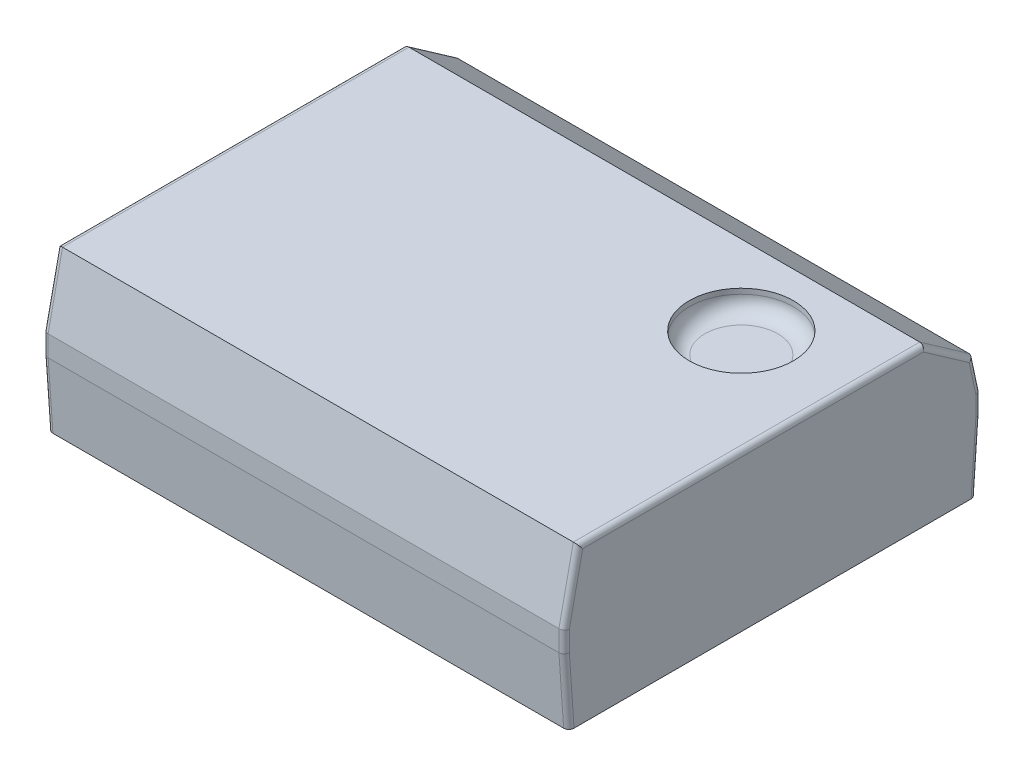
ISO-10303-21;
HEADER;
FILE_DESCRIPTION(('STEP AP214'),'2;1');
FILE_NAME('part.step','',(''),(''),'','','');
FILE_SCHEMA(('AUTOMOTIVE_DESIGN { 1 0 10303 214 1 1 1 1 }'));
ENDSEC;
DATA;
#1=APPLICATION_CONTEXT('core data for automotive mechanical design processes');
#2=APPLICATION_PROTOCOL_DEFINITION('international standard','automotive_design',2000,#1);
#3=PRODUCT_CONTEXT('',#1,'mechanical');
#4=PRODUCT('Part','Part','',(#3));
#5=PRODUCT_RELATED_PRODUCT_CATEGORY('part','',(#4));
#6=PRODUCT_DEFINITION_FORMATION('','',#4);
#7=PRODUCT_DEFINITION_CONTEXT('part definition',#1,'design');
#8=PRODUCT_DEFINITION('design','',#6,#7);
#9=PRODUCT_DEFINITION_SHAPE('','',#8);
#10=(LENGTH_UNIT() NAMED_UNIT(*) SI_UNIT(.MILLI.,.METRE.));
#11=(NAMED_UNIT(*) PLANE_ANGLE_UNIT() SI_UNIT($,.RADIAN.));
#12=(NAMED_UNIT(*) SI_UNIT($,.STERADIAN.) SOLID_ANGLE_UNIT());
#13=UNCERTAINTY_MEASURE_WITH_UNIT(LENGTH_MEASURE(1.E-05),#10,'distance_accuracy_value','');
#14=(GEOMETRIC_REPRESENTATION_CONTEXT(3) GLOBAL_UNCERTAINTY_ASSIGNED_CONTEXT((#13)) GLOBAL_UNIT_ASSIGNED_CONTEXT((#10,
#11,#12)) REPRESENTATION_CONTEXT('',''));
#15=CARTESIAN_POINT('',(0.,0.,0.));
#16=DIRECTION('',(0.,0.,1.));
#17=DIRECTION('',(1.,0.,0.));
#18=AXIS2_PLACEMENT_3D('',#15,#16,#17);
#19=CARTESIAN_POINT('',(1.5,0.55,-0.7));
#20=DIRECTION('',(0.,1.,0.));
#21=DIRECTION('',(0.,0.,1.));
#22=AXIS2_PLACEMENT_3D('',#19,#20,#21);
#23=PLANE('',#22);
#24=CARTESIAN_POINT('',(1.5,0.55,-0.7));
#25=DIRECTION('',(0.,1.,0.));
#26=DIRECTION('',(0.,0.,1.));
#27=AXIS2_PLACEMENT_3D('',#24,#25,#26);
#28=CIRCLE('',#27,0.35);
#29=CARTESIAN_POINT('',(1.5,0.55,-0.35));
#30=VERTEX_POINT('',#29);
#31=EDGE_CURVE('E21',#30,#30,#28,.T.);
#32=ORIENTED_EDGE('',*,*,#31,.T.);
#33=EDGE_LOOP('',(#32));
#34=FACE_BOUND('',#33,.T.);
#35=ADVANCED_FACE('F17',(#34),#23,.T.);
#36=CARTESIAN_POINT('',(1.5,0.7,-0.7));
#37=DIRECTION('',(0.,1.,0.));
#38=DIRECTION('',(0.,0.,1.));
#39=AXIS2_PLACEMENT_3D('',#36,#37,#38);
#40=TOROIDAL_SURFACE('',#39,0.35,0.15);
#41=ORIENTED_EDGE('',*,*,#31,.F.);
#42=EDGE_LOOP('',(#41));
#43=FACE_BOUND('',#42,.T.);
#44=CARTESIAN_POINT('',(1.5,0.7,-0.7));
#45=DIRECTION('',(0.,1.,0.));
#46=DIRECTION('',(0.,0.,1.));
#47=AXIS2_PLACEMENT_3D('',#44,#45,#46);
#48=CIRCLE('',#47,0.5);
#49=CARTESIAN_POINT('',(1.5,0.7,-0.2));
#50=VERTEX_POINT('',#49);
#51=EDGE_CURVE('E194',#50,#50,#48,.T.);
#52=ORIENTED_EDGE('',*,*,#51,.T.);
#53=EDGE_LOOP('',(#52));
#54=FACE_BOUND('',#53,.T.);
#55=ADVANCED_FACE('F19',(#43,#54),#40,.F.);
#56=CARTESIAN_POINT('',(-2.5,0.75,-1.461838234914));
#57=DIRECTION('',(0.,0.819152044289016,-0.573576436351011));
#58=DIRECTION('',(0.,0.573576436351011,0.819152044289016));
#59=AXIS2_PLACEMENT_3D('',#56,#57,#58);
#60=PLANE('',#59);
#61=DIRECTION('',(1.,0.,0.));
#62=VECTOR('',#61,1.);
#63=CARTESIAN_POINT('',(-2.5,0.420942073817915,-1.9317816562936));
#64=LINE('',#63,#62);
#65=CARTESIAN_POINT('',(2.45,0.420942073817686,-1.93178165629399));
#66=VERTEX_POINT('',#65);
#67=CARTESIAN_POINT('',(-2.45,0.420942073817897,-1.93178165629393));
#68=VERTEX_POINT('',#67);
#69=EDGE_CURVE('E188',#66,#68,#64,.F.);
#70=ORIENTED_EDGE('',*,*,#69,.T.);
#71=DIRECTION('',(0.,0.573576436351011,0.819152044289016));
#72=VECTOR('',#71,1.);
#73=CARTESIAN_POINT('',(-2.45,0.75,-1.461838234914));
#74=LINE('',#73,#72);
#75=CARTESIAN_POINT('',(-2.45,0.749999999999773,-1.46183823491432));
#76=VERTEX_POINT('',#75);
#77=EDGE_CURVE('E198',#68,#76,#74,.T.);
#78=ORIENTED_EDGE('',*,*,#77,.T.);
#79=DIRECTION('',(1.,0.,0.));
#80=VECTOR('',#79,1.);
#81=CARTESIAN_POINT('',(-2.5,0.75,-1.461838234914));
#82=LINE('',#81,#80);
#83=CARTESIAN_POINT('',(2.45,0.749999999999773,-1.46183823491432));
#84=VERTEX_POINT('',#83);
#85=EDGE_CURVE('E178',#84,#76,#82,.F.);
#86=ORIENTED_EDGE('',*,*,#85,.F.);
#87=DIRECTION('',(0.,0.573576436351011,0.819152044289016));
#88=VECTOR('',#87,1.);
#89=CARTESIAN_POINT('',(2.45,0.75,-1.461838234914));
#90=LINE('',#89,#88);
#91=EDGE_CURVE('E196',#84,#66,#90,.F.);
#92=ORIENTED_EDGE('',*,*,#91,.T.);
#93=EDGE_LOOP('',(#70,#78,#86,#92));
#94=FACE_BOUND('',#93,.T.);
#95=ADVANCED_FACE('F261',(#94),#60,.T.);
#96=CARTESIAN_POINT('',(1.5,0.55,-0.7));
#97=DIRECTION('',(0.,1.,0.));
#98=DIRECTION('',(0.,0.,1.));
#99=AXIS2_PLACEMENT_3D('',#96,#97,#98);
#100=CYLINDRICAL_SURFACE('',#99,0.5);
#101=ORIENTED_EDGE('',*,*,#51,.F.);
#102=EDGE_LOOP('',(#101));
#103=FACE_BOUND('',#102,.T.);
#104=CARTESIAN_POINT('',(1.5,0.75,-0.7));
#105=DIRECTION('',(0.,1.,0.));
#106=DIRECTION('',(0.,0.,1.));
#107=AXIS2_PLACEMENT_3D('',#104,#105,#106);
#108=CIRCLE('',#107,0.5);
#109=CARTESIAN_POINT('',(1.5,0.75,-0.2));
#110=VERTEX_POINT('',#109);
#111=EDGE_CURVE('E174',#110,#110,#108,.F.);
#112=ORIENTED_EDGE('',*,*,#111,.F.);
#113=EDGE_LOOP('',(#112));
#114=FACE_BOUND('',#113,.T.);
#115=ADVANCED_FACE('F258',(#103,#114),#100,.F.);
#116=CARTESIAN_POINT('',(-2.5,0.75,1.861838234914));
#117=DIRECTION('',(0.,-0.20791169081795,-0.978147600733765));
#118=DIRECTION('',(0.,0.978147600733765,-0.20791169081795));
#119=AXIS2_PLACEMENT_3D('',#116,#117,#118);
#120=PLANE('',#119);
#121=DIRECTION('',(1.,0.,0.));
#122=VECTOR('',#121,1.);
#123=CARTESIAN_POINT('',(-2.5,0.09999999999999,2.));
#124=LINE('',#123,#122);
#125=CARTESIAN_POINT('',(2.45,0.0999999999997729,1.9999999999997));
#126=VERTEX_POINT('',#125);
#127=CARTESIAN_POINT('',(-2.45,0.0999999999997729,1.9999999999997));
#128=VERTEX_POINT('',#127);
#129=EDGE_CURVE('E171',#126,#128,#124,.F.);
#130=ORIENTED_EDGE('',*,*,#129,.F.);
#131=DIRECTION('',(0.,0.978147600733765,-0.20791169081795));
#132=VECTOR('',#131,1.);
#133=CARTESIAN_POINT('',(2.45,0.75,1.861838234914));
#134=LINE('',#133,#132);
#135=CARTESIAN_POINT('',(2.45,0.749999999999695,1.86183823491438));
#136=VERTEX_POINT('',#135);
#137=EDGE_CURVE('E192',#136,#126,#134,.F.);
#138=ORIENTED_EDGE('',*,*,#137,.F.);
#139=DIRECTION('',(1.,0.,0.));
#140=VECTOR('',#139,1.);
#141=CARTESIAN_POINT('',(-2.5,0.75,1.861838234914));
#142=LINE('',#141,#140);
#143=CARTESIAN_POINT('',(-2.45,0.749999999999695,1.86183823491438));
#144=VERTEX_POINT('',#143);
#145=EDGE_CURVE('E175',#144,#136,#142,.T.);
#146=ORIENTED_EDGE('',*,*,#145,.F.);
#147=DIRECTION('',(0.,0.978147600733765,-0.20791169081795));
#148=VECTOR('',#147,1.);
#149=CARTESIAN_POINT('',(-2.45,0.75,1.861838234914));
#150=LINE('',#149,#148);
#151=EDGE_CURVE('E191',#128,#144,#150,.T.);
#152=ORIENTED_EDGE('',*,*,#151,.F.);
#153=EDGE_LOOP('',(#130,#138,#146,#152));
#154=FACE_BOUND('',#153,.T.);
#155=ADVANCED_FACE('F260',(#154),#120,.F.);
#156=CARTESIAN_POINT('',(-2.5,0.75,-1.861838234914));
#157=DIRECTION('',(0.,-0.20791169081795,0.978147600733765));
#158=DIRECTION('',(0.,-0.978147600733765,-0.20791169081795));
#159=AXIS2_PLACEMENT_3D('',#156,#157,#158);
#160=PLANE('',#159);
#161=ORIENTED_EDGE('',*,*,#69,.F.);
#162=DIRECTION('',(0.,-0.978147600733765,-0.20791169081795));
#163=VECTOR('',#162,1.);
#164=CARTESIAN_POINT('',(2.45,-0.713256819498102,-2.17286307330769));
#165=LINE('',#164,#163);
#166=CARTESIAN_POINT('',(2.45,0.100000000000721,-2.));
#167=VERTEX_POINT('',#166);
#168=EDGE_CURVE('E251',#167,#66,#165,.F.);
#169=ORIENTED_EDGE('',*,*,#168,.F.);
#170=DIRECTION('',(-1.,0.,0.));
#171=VECTOR('',#170,1.);
#172=CARTESIAN_POINT('',(-2.5,0.09999999999999,-2.));
#173=LINE('',#172,#171);
#174=CARTESIAN_POINT('',(-2.45,0.0999999999998614,-1.99999999999968));
#175=VERTEX_POINT('',#174);
#176=EDGE_CURVE('E182',#175,#167,#173,.F.);
#177=ORIENTED_EDGE('',*,*,#176,.F.);
#178=DIRECTION('',(0.,-0.978147600733765,-0.20791169081795));
#179=VECTOR('',#178,1.);
#180=CARTESIAN_POINT('',(-2.45,0.75,-1.861838234914));
#181=LINE('',#180,#179);
#182=EDGE_CURVE('E179',#68,#175,#181,.T.);
#183=ORIENTED_EDGE('',*,*,#182,.F.);
#184=EDGE_LOOP('',(#161,#169,#177,#183));
#185=FACE_BOUND('',#184,.T.);
#186=ADVANCED_FACE('F269',(#185),#160,.F.);
#187=CARTESIAN_POINT('',(-2.5,0.75,2.));
#188=DIRECTION('',(0.,1.,0.));
#189=DIRECTION('',(0.,0.,1.));
#190=AXIS2_PLACEMENT_3D('',#187,#188,#189);
#191=PLANE('',#190);
#192=ORIENTED_EDGE('',*,*,#111,.T.);
#193=EDGE_LOOP('',(#192));
#194=FACE_BOUND('',#193,.T.);
#195=ORIENTED_EDGE('',*,*,#85,.T.);
#196=DIRECTION('',(0.,0.,1.));
#197=VECTOR('',#196,1.);
#198=CARTESIAN_POINT('',(-2.45,0.75,2.));
#199=LINE('',#198,#197);
#200=EDGE_CURVE('E240',#144,#76,#199,.F.);
#201=ORIENTED_EDGE('',*,*,#200,.F.);
#202=ORIENTED_EDGE('',*,*,#145,.T.);
#203=DIRECTION('',(0.,0.,-1.));
#204=VECTOR('',#203,1.);
#205=CARTESIAN_POINT('',(2.45,0.75,2.));
#206=LINE('',#205,#204);
#207=EDGE_CURVE('E156',#84,#136,#206,.F.);
#208=ORIENTED_EDGE('',*,*,#207,.F.);
#209=EDGE_LOOP('',(#195,#201,#202,#208));
#210=FACE_BOUND('',#209,.T.);
#211=ADVANCED_FACE('F255',(#194,#210),#191,.T.);
#212=CARTESIAN_POINT('',(-2.5,-0.75,2.));
#213=DIRECTION('',(0.,0.,1.));
#214=DIRECTION('',(1.,0.,0.));
#215=AXIS2_PLACEMENT_3D('',#212,#213,#214);
#216=PLANE('',#215);
#217=ORIENTED_EDGE('',*,*,#129,.T.);
#218=DIRECTION('',(0.,1.,0.));
#219=VECTOR('',#218,1.);
#220=CARTESIAN_POINT('',(-2.45,-0.75,2.));
#221=LINE('',#220,#219);
#222=CARTESIAN_POINT('',(-2.45,-0.0999999999989838,2.));
#223=VERTEX_POINT('',#222);
#224=EDGE_CURVE('E231',#223,#128,#221,.T.);
#225=ORIENTED_EDGE('',*,*,#224,.F.);
#226=DIRECTION('',(1.,0.,0.));
#227=VECTOR('',#226,1.);
#228=CARTESIAN_POINT('',(-2.5,-0.09999999999998,2.));
#229=LINE('',#228,#227);
#230=CARTESIAN_POINT('',(2.45,-0.0999999999989839,2.));
#231=VERTEX_POINT('',#230);
#232=EDGE_CURVE('E228',#231,#223,#229,.F.);
#233=ORIENTED_EDGE('',*,*,#232,.F.);
#234=DIRECTION('',(0.,1.,0.));
#235=VECTOR('',#234,1.);
#236=CARTESIAN_POINT('',(2.45,-0.75,2.));
#237=LINE('',#236,#235);
#238=EDGE_CURVE('E169',#126,#231,#237,.F.);
#239=ORIENTED_EDGE('',*,*,#238,.F.);
#240=EDGE_LOOP('',(#217,#225,#233,#239));
#241=FACE_BOUND('',#240,.T.);
#242=ADVANCED_FACE('F360',(#241),#216,.T.);
#243=CARTESIAN_POINT('',(2.45,0.7,2.));
#244=DIRECTION('',(0.,0.,-1.));
#245=DIRECTION('',(-1.,0.,0.));
#246=AXIS2_PLACEMENT_3D('',#243,#244,#245);
#247=CYLINDRICAL_SURFACE('',#246,0.05);
#248=CARTESIAN_POINT('',(2.45,0.7,1.82134903325488));
#249=DIRECTION('',(0.,0.629320391049762,-0.777145961457032));
#250=DIRECTION('',(0.,0.777145961457032,0.629320391049762));
#251=AXIS2_PLACEMENT_3D('',#248,#249,#250);
#252=ELLIPSE('',#251,0.0643379782946533,0.05);
#253=CARTESIAN_POINT('',(2.5,0.700000000000058,1.82134903325493));
#254=VERTEX_POINT('',#253);
#255=EDGE_CURVE('E153',#254,#136,#252,.F.);
#256=ORIENTED_EDGE('',*,*,#255,.F.);
#257=DIRECTION('',(0.,0.,-1.));
#258=VECTOR('',#257,1.);
#259=CARTESIAN_POINT('',(2.5,0.7,-2.));
#260=LINE('',#259,#258);
#261=CARTESIAN_POINT('',(2.5,0.700000000000045,-1.44607329547094));
#262=VERTEX_POINT('',#261);
#263=EDGE_CURVE('E139',#262,#254,#260,.F.);
#264=ORIENTED_EDGE('',*,*,#263,.F.);
#265=CARTESIAN_POINT('',(2.45,0.7,-1.44607329547084));
#266=DIRECTION('',(0.,0.300705799504253,0.953716950748233));
#267=DIRECTION('',(0.,0.953716950748233,-0.300705799504253));
#268=AXIS2_PLACEMENT_3D('',#265,#266,#267);
#269=ELLIPSE('',#268,0.0524264562570402,0.05);
#270=EDGE_CURVE('E249',#84,#262,#269,.F.);
#271=ORIENTED_EDGE('',*,*,#270,.F.);
#272=ORIENTED_EDGE('',*,*,#207,.T.);
#273=EDGE_LOOP('',(#256,#264,#271,#272));
#274=FACE_BOUND('',#273,.T.);
#275=ADVANCED_FACE('F154',(#274),#247,.T.);
#276=CARTESIAN_POINT('',(2.45,0.08982088211259,1.951046608556));
#277=DIRECTION('',(0.,0.978147600733765,-0.20791169081795));
#278=DIRECTION('',(0.,0.20791169081795,0.978147600733765));
#279=AXIS2_PLACEMENT_3D('',#276,#277,#278);
#280=CYLINDRICAL_SURFACE('',#279,0.05);
#281=CARTESIAN_POINT('',(2.45,0.0947447882379816,1.95));
#282=DIRECTION('',(0.,0.994521895368263,-0.10452846326775));
#283=DIRECTION('',(0.,0.104528463267751,0.994521895368263));
#284=AXIS2_PLACEMENT_3D('',#281,#282,#283);
#285=ELLIPSE('',#284,0.0502754139781763,0.05);
#286=CARTESIAN_POINT('',(2.5,0.094744788237332,1.94999999999987));
#287=VERTEX_POINT('',#286);
#288=EDGE_CURVE('E158',#287,#126,#285,.F.);
#289=ORIENTED_EDGE('',*,*,#288,.F.);
#290=DIRECTION('',(0.,-0.978147600733893,0.207911690817348));
#291=VECTOR('',#290,1.);
#292=CARTESIAN_POINT('',(2.5,0.7,1.821349033255));
#293=LINE('',#292,#291);
#294=EDGE_CURVE('E143',#254,#287,#293,.T.);
#295=ORIENTED_EDGE('',*,*,#294,.F.);
#296=ORIENTED_EDGE('',*,*,#255,.T.);
#297=ORIENTED_EDGE('',*,*,#137,.T.);
#298=EDGE_LOOP('',(#289,#295,#296,#297));
#299=FACE_BOUND('',#298,.T.);
#300=ADVANCED_FACE('F160',(#299),#280,.T.);
#301=CARTESIAN_POINT('',(2.45,-0.75,1.95));
#302=DIRECTION('',(0.,1.,0.));
#303=DIRECTION('',(0.,0.,1.));
#304=AXIS2_PLACEMENT_3D('',#301,#302,#303);
#305=CYLINDRICAL_SURFACE('',#304,0.05);
#306=CARTESIAN_POINT('',(2.45,-0.0982539615234109,1.95));
#307=DIRECTION('',(0.,-0.999390827019096,-0.0348994967024922));
#308=DIRECTION('',(0.,0.0348994967024914,-0.999390827019096));
#309=AXIS2_PLACEMENT_3D('',#306,#307,#308);
#310=ELLIPSE('',#309,0.0500304772149411,0.05);
#311=CARTESIAN_POINT('',(2.5,-0.0982539615244007,1.95));
#312=VERTEX_POINT('',#311);
#313=EDGE_CURVE('E225',#312,#231,#310,.T.);
#314=ORIENTED_EDGE('',*,*,#313,.F.);
#315=DIRECTION('',(0.,1.,0.));
#316=VECTOR('',#315,1.);
#317=CARTESIAN_POINT('',(2.5,-0.75,1.95));
#318=LINE('',#317,#316);
#319=EDGE_CURVE('E163',#287,#312,#318,.F.);
#320=ORIENTED_EDGE('',*,*,#319,.F.);
#321=ORIENTED_EDGE('',*,*,#288,.T.);
#322=ORIENTED_EDGE('',*,*,#238,.T.);
#323=EDGE_LOOP('',(#314,#320,#321,#322));
#324=FACE_BOUND('',#323,.T.);
#325=ADVANCED_FACE('F351',(#324),#305,.T.);
#326=CARTESIAN_POINT('',(2.45,-0.723652404039,-2.123955693271));
#327=DIRECTION('',(0.,-0.978147600733765,-0.20791169081795));
#328=DIRECTION('',(0.,0.20791169081795,-0.978147600733765));
#329=AXIS2_PLACEMENT_3D('',#326,#327,#328);
#330=CYLINDRICAL_SURFACE('',#329,0.05);
#331=CARTESIAN_POINT('',(2.45,0.0947447882381625,-1.95));
#332=DIRECTION('',(0.,0.994521895368263,0.10452846326775));
#333=DIRECTION('',(0.,0.104528463267751,-0.994521895368263));
#334=AXIS2_PLACEMENT_3D('',#331,#332,#333);
#335=ELLIPSE('',#334,0.0502754139781763,0.05);
#336=CARTESIAN_POINT('',(2.5,0.0947447882374181,-1.94999999999985));
#337=VERTEX_POINT('',#336);
#338=EDGE_CURVE('E186',#167,#337,#335,.F.);
#339=ORIENTED_EDGE('',*,*,#338,.F.);
#340=ORIENTED_EDGE('',*,*,#168,.T.);
#341=CARTESIAN_POINT('',(2.45,0.391281359945863,-1.88696920590833));
#342=DIRECTION('',(0.,0.833885822067103,0.551936985312157));
#343=DIRECTION('',(0.,-0.551936985312157,0.833885822067103));
#344=AXIS2_PLACEMENT_3D('',#341,#342,#343);
#345=ELLIPSE('',#344,0.053739312025721,0.05);
#346=CARTESIAN_POINT('',(2.5,0.391281359945843,-1.88696920590803));
#347=VERTEX_POINT('',#346);
#348=EDGE_CURVE('E246',#347,#66,#345,.T.);
#349=ORIENTED_EDGE('',*,*,#348,.F.);
#350=DIRECTION('',(0.,0.978147600733769,0.207911690817933));
#351=VECTOR('',#350,1.);
#352=CARTESIAN_POINT('',(2.5,0.0947447882367,-1.95));
#353=LINE('',#352,#351);
#354=EDGE_CURVE('E380',#337,#347,#353,.T.);
#355=ORIENTED_EDGE('',*,*,#354,.F.);
#356=EDGE_LOOP('',(#339,#340,#349,#355));
#357=FACE_BOUND('',#356,.T.);
#358=ADVANCED_FACE('F347',(#357),#330,.T.);
#359=CARTESIAN_POINT('',(2.45,-0.03729581444019,-2.499040843243));
#360=DIRECTION('',(0.,0.573576436351011,0.819152044289016));
#361=DIRECTION('',(0.,-0.819152044289016,0.573576436351011));
#362=AXIS2_PLACEMENT_3D('',#359,#360,#361);
#363=CYLINDRICAL_SURFACE('',#362,0.05);
#364=ORIENTED_EDGE('',*,*,#348,.T.);
#365=ORIENTED_EDGE('',*,*,#91,.F.);
#366=ORIENTED_EDGE('',*,*,#270,.T.);
#367=DIRECTION('',(0.,0.57357643635127,0.819152044288835));
#368=VECTOR('',#367,1.);
#369=CARTESIAN_POINT('',(2.5,0.391281359946,-1.886969205908));
#370=LINE('',#369,#368);
#371=EDGE_CURVE('E146',#347,#262,#370,.T.);
#372=ORIENTED_EDGE('',*,*,#371,.F.);
#373=EDGE_LOOP('',(#364,#365,#366,#372));
#374=FACE_BOUND('',#373,.T.);
#375=ADVANCED_FACE('F343',(#374),#363,.T.);
#376=CARTESIAN_POINT('',(2.45,-0.75,-1.95));
#377=DIRECTION('',(0.,1.,0.));
#378=DIRECTION('',(0.,0.,1.));
#379=AXIS2_PLACEMENT_3D('',#376,#377,#378);
#380=CYLINDRICAL_SURFACE('',#379,0.05);
#381=CARTESIAN_POINT('',(2.45,-0.098253961525626,-1.95));
#382=DIRECTION('',(0.,0.999390827019096,-0.0348994967024922));
#383=DIRECTION('',(0.,-0.0348994967024914,-0.999390827019096));
#384=AXIS2_PLACEMENT_3D('',#381,#382,#383);
#385=ELLIPSE('',#384,0.0500304772149411,0.05);
#386=CARTESIAN_POINT('',(2.45,-0.100000000000086,-2.));
#387=VERTEX_POINT('',#386);
#388=CARTESIAN_POINT('',(2.5,-0.0982539615255028,-1.94999999999999));
#389=VERTEX_POINT('',#388);
#390=EDGE_CURVE('E222',#387,#389,#385,.F.);
#391=ORIENTED_EDGE('',*,*,#390,.F.);
#392=DIRECTION('',(0.,1.,0.));
#393=VECTOR('',#392,1.);
#394=CARTESIAN_POINT('',(2.45,-0.75,-2.));
#395=LINE('',#394,#393);
#396=EDGE_CURVE('E185',#167,#387,#395,.F.);
#397=ORIENTED_EDGE('',*,*,#396,.F.);
#398=ORIENTED_EDGE('',*,*,#338,.T.);
#399=DIRECTION('',(0.,1.,0.));
#400=VECTOR('',#399,1.);
#401=CARTESIAN_POINT('',(2.5,-0.75,-1.95));
#402=LINE('',#401,#400);
#403=EDGE_CURVE('E382',#389,#337,#402,.T.);
#404=ORIENTED_EDGE('',*,*,#403,.F.);
#405=EDGE_LOOP('',(#391,#397,#398,#404));
#406=FACE_BOUND('',#405,.T.);
#407=ADVANCED_FACE('F339',(#406),#380,.T.);
#408=CARTESIAN_POINT('',(-2.5,-0.75,-2.));
#409=DIRECTION('',(0.,0.,-1.));
#410=DIRECTION('',(-1.,0.,0.));
#411=AXIS2_PLACEMENT_3D('',#408,#409,#410);
#412=PLANE('',#411);
#413=DIRECTION('',(1.,0.,0.));
#414=VECTOR('',#413,1.);
#415=CARTESIAN_POINT('',(-2.5,-0.0999999999999899,-2.));
#416=LINE('',#415,#414);
#417=CARTESIAN_POINT('',(-2.45,-0.100000000000102,-2.));
#418=VERTEX_POINT('',#417);
#419=EDGE_CURVE('E388',#418,#387,#416,.T.);
#420=ORIENTED_EDGE('',*,*,#419,.F.);
#421=DIRECTION('',(0.,1.,0.));
#422=VECTOR('',#421,1.);
#423=CARTESIAN_POINT('',(-2.45,-0.75,-2.));
#424=LINE('',#423,#422);
#425=EDGE_CURVE('E244',#175,#418,#424,.F.);
#426=ORIENTED_EDGE('',*,*,#425,.F.);
#427=ORIENTED_EDGE('',*,*,#176,.T.);
#428=ORIENTED_EDGE('',*,*,#396,.T.);
#429=EDGE_LOOP('',(#420,#426,#427,#428));
#430=FACE_BOUND('',#429,.T.);
#431=ADVANCED_FACE('F335',(#430),#412,.T.);
#432=CARTESIAN_POINT('',(-2.45,-0.75,-1.95));
#433=DIRECTION('',(0.,1.,0.));
#434=DIRECTION('',(0.,0.,1.));
#435=AXIS2_PLACEMENT_3D('',#432,#433,#434);
#436=CYLINDRICAL_SURFACE('',#435,0.05);
#437=CARTESIAN_POINT('',(-2.45,-0.098253961525626,-1.95));
#438=DIRECTION('',(0.,-0.999390827019096,0.0348994967024922));
#439=DIRECTION('',(0.,0.0348994967024914,0.999390827019096));
#440=AXIS2_PLACEMENT_3D('',#437,#438,#439);
#441=ELLIPSE('',#440,0.0500304772149411,0.05);
#442=CARTESIAN_POINT('',(-2.5,-0.0982539615254964,-1.94999999999999));
#443=VERTEX_POINT('',#442);
#444=EDGE_CURVE('E217',#443,#418,#441,.T.);
#445=ORIENTED_EDGE('',*,*,#444,.F.);
#446=DIRECTION('',(0.,1.,0.));
#447=VECTOR('',#446,1.);
#448=CARTESIAN_POINT('',(-2.5,-0.75,-1.95));
#449=LINE('',#448,#447);
#450=CARTESIAN_POINT('',(-2.5,0.0947447882374152,-1.94999999999985));
#451=VERTEX_POINT('',#450);
#452=EDGE_CURVE('E400',#451,#443,#449,.F.);
#453=ORIENTED_EDGE('',*,*,#452,.F.);
#454=CARTESIAN_POINT('',(-2.45,0.0947447882381626,-1.95));
#455=DIRECTION('',(0.,0.994521895368263,0.10452846326775));
#456=DIRECTION('',(0.,-0.104528463267751,0.994521895368263));
#457=AXIS2_PLACEMENT_3D('',#454,#455,#456);
#458=ELLIPSE('',#457,0.0502754139781763,0.05);
#459=EDGE_CURVE('E232',#175,#451,#458,.T.);
#460=ORIENTED_EDGE('',*,*,#459,.F.);
#461=ORIENTED_EDGE('',*,*,#425,.T.);
#462=EDGE_LOOP('',(#445,#453,#460,#461));
#463=FACE_BOUND('',#462,.T.);
#464=ADVANCED_FACE('F331',(#463),#436,.T.);
#465=CARTESIAN_POINT('',(-2.45,0.08982088211259,1.951046608556));
#466=DIRECTION('',(0.,-0.978147600733765,0.20791169081795));
#467=DIRECTION('',(0.,-0.20791169081795,-0.978147600733765));
#468=AXIS2_PLACEMENT_3D('',#465,#466,#467);
#469=CYLINDRICAL_SURFACE('',#468,0.05);
#470=CARTESIAN_POINT('',(-2.45,0.0947447882379816,1.95));
#471=DIRECTION('',(0.,0.994521895368263,-0.10452846326775));
#472=DIRECTION('',(0.,0.104528463267751,0.994521895368263));
#473=AXIS2_PLACEMENT_3D('',#470,#471,#472);
#474=ELLIPSE('',#473,0.0502754139781763,0.05);
#475=CARTESIAN_POINT('',(-2.5,0.0947447882373262,1.94999999999987));
#476=VERTEX_POINT('',#475);
#477=EDGE_CURVE('E229',#128,#476,#474,.F.);
#478=ORIENTED_EDGE('',*,*,#477,.F.);
#479=ORIENTED_EDGE('',*,*,#151,.T.);
#480=CARTESIAN_POINT('',(-2.45,0.7,1.82134903325488));
#481=DIRECTION('',(0.,-0.629320391049762,0.777145961457032));
#482=DIRECTION('',(0.,0.777145961457032,0.629320391049762));
#483=AXIS2_PLACEMENT_3D('',#480,#481,#482);
#484=ELLIPSE('',#483,0.0643379782946533,0.05);
#485=CARTESIAN_POINT('',(-2.5,0.700000000000058,1.82134903325493));
#486=VERTEX_POINT('',#485);
#487=EDGE_CURVE('E241',#486,#144,#484,.F.);
#488=ORIENTED_EDGE('',*,*,#487,.F.);
#489=DIRECTION('',(0.,0.978147600733894,-0.207911690817345));
#490=VECTOR('',#489,1.);
#491=CARTESIAN_POINT('',(-2.5,0.0947447882367,1.95));
#492=LINE('',#491,#490);
#493=EDGE_CURVE('E392',#476,#486,#492,.T.);
#494=ORIENTED_EDGE('',*,*,#493,.F.);
#495=EDGE_LOOP('',(#478,#479,#488,#494));
#496=FACE_BOUND('',#495,.T.);
#497=ADVANCED_FACE('F327',(#496),#469,.T.);
#498=CARTESIAN_POINT('',(-2.45,0.7,2.));
#499=DIRECTION('',(0.,0.,1.));
#500=DIRECTION('',(1.,0.,0.));
#501=AXIS2_PLACEMENT_3D('',#498,#499,#500);
#502=CYLINDRICAL_SURFACE('',#501,0.05);
#503=CARTESIAN_POINT('',(-2.45,0.7,-1.44607329547084));
#504=DIRECTION('',(0.,-0.300705799504253,-0.953716950748233));
#505=DIRECTION('',(0.,-0.953716950748233,0.300705799504253));
#506=AXIS2_PLACEMENT_3D('',#503,#504,#505);
#507=ELLIPSE('',#506,0.0524264562570402,0.05);
#508=CARTESIAN_POINT('',(-2.5,0.700000000000045,-1.44607329547094));
#509=VERTEX_POINT('',#508);
#510=EDGE_CURVE('E237',#509,#76,#507,.T.);
#511=ORIENTED_EDGE('',*,*,#510,.F.);
#512=DIRECTION('',(0.,0.,1.));
#513=VECTOR('',#512,1.);
#514=CARTESIAN_POINT('',(-2.5,0.7,-2.));
#515=LINE('',#514,#513);
#516=EDGE_CURVE('E394',#486,#509,#515,.F.);
#517=ORIENTED_EDGE('',*,*,#516,.F.);
#518=ORIENTED_EDGE('',*,*,#487,.T.);
#519=ORIENTED_EDGE('',*,*,#200,.T.);
#520=EDGE_LOOP('',(#511,#517,#518,#519));
#521=FACE_BOUND('',#520,.T.);
#522=ADVANCED_FACE('F323',(#521),#502,.T.);
#523=CARTESIAN_POINT('',(-2.45,-0.03729581444019,-2.499040843243));
#524=DIRECTION('',(0.,-0.573576436351011,-0.819152044289016));
#525=DIRECTION('',(0.,0.819152044289016,-0.573576436351011));
#526=AXIS2_PLACEMENT_3D('',#523,#524,#525);
#527=CYLINDRICAL_SURFACE('',#526,0.05);
#528=CARTESIAN_POINT('',(-2.45,0.391281359945863,-1.88696920590833));
#529=DIRECTION('',(0.,0.833885822067103,0.551936985312157));
#530=DIRECTION('',(0.,0.551936985312157,-0.833885822067103));
#531=AXIS2_PLACEMENT_3D('',#528,#529,#530);
#532=ELLIPSE('',#531,0.053739312025721,0.05);
#533=CARTESIAN_POINT('',(-2.5,0.391281359945843,-1.88696920590803));
#534=VERTEX_POINT('',#533);
#535=EDGE_CURVE('E234',#534,#68,#532,.F.);
#536=ORIENTED_EDGE('',*,*,#535,.F.);
#537=DIRECTION('',(0.,-0.57357643635127,-0.819152044288835));
#538=VECTOR('',#537,1.);
#539=CARTESIAN_POINT('',(-2.5,0.7,-1.446073295471));
#540=LINE('',#539,#538);
#541=EDGE_CURVE('E399',#509,#534,#540,.T.);
#542=ORIENTED_EDGE('',*,*,#541,.F.);
#543=ORIENTED_EDGE('',*,*,#510,.T.);
#544=ORIENTED_EDGE('',*,*,#77,.F.);
#545=EDGE_LOOP('',(#536,#542,#543,#544));
#546=FACE_BOUND('',#545,.T.);
#547=ADVANCED_FACE('F319',(#546),#527,.T.);
#548=CARTESIAN_POINT('',(-2.45,-0.723652404039,-2.123955693271));
#549=DIRECTION('',(0.,0.978147600733765,0.20791169081795));
#550=DIRECTION('',(0.,-0.20791169081795,0.978147600733765));
#551=AXIS2_PLACEMENT_3D('',#548,#549,#550);
#552=CYLINDRICAL_SURFACE('',#551,0.05);
#553=ORIENTED_EDGE('',*,*,#459,.T.);
#554=DIRECTION('',(0.,-0.978147600733769,-0.207911690817933));
#555=VECTOR('',#554,1.);
#556=CARTESIAN_POINT('',(-2.5,0.391281359946,-1.886969205908));
#557=LINE('',#556,#555);
#558=EDGE_CURVE('E216',#534,#451,#557,.T.);
#559=ORIENTED_EDGE('',*,*,#558,.F.);
#560=ORIENTED_EDGE('',*,*,#535,.T.);
#561=ORIENTED_EDGE('',*,*,#182,.T.);
#562=EDGE_LOOP('',(#553,#559,#560,#561));
#563=FACE_BOUND('',#562,.T.);
#564=ADVANCED_FACE('F315',(#563),#552,.T.);
#565=CARTESIAN_POINT('',(-2.45,-0.75,1.95));
#566=DIRECTION('',(0.,1.,0.));
#567=DIRECTION('',(0.,0.,1.));
#568=AXIS2_PLACEMENT_3D('',#565,#566,#567);
#569=CYLINDRICAL_SURFACE('',#568,0.05);
#570=CARTESIAN_POINT('',(-2.45,-0.0982539615234109,1.95));
#571=DIRECTION('',(0.,0.999390827019096,0.0348994967024922));
#572=DIRECTION('',(0.,-0.0348994967024914,0.999390827019096));
#573=AXIS2_PLACEMENT_3D('',#570,#571,#572);
#574=ELLIPSE('',#573,0.0500304772149411,0.05);
#575=CARTESIAN_POINT('',(-2.5,-0.0982539615243782,1.95000000000007));
#576=VERTEX_POINT('',#575);
#577=EDGE_CURVE('E214',#223,#576,#574,.F.);
#578=ORIENTED_EDGE('',*,*,#577,.F.);
#579=ORIENTED_EDGE('',*,*,#224,.T.);
#580=ORIENTED_EDGE('',*,*,#477,.T.);
#581=DIRECTION('',(0.,1.,0.));
#582=VECTOR('',#581,1.);
#583=CARTESIAN_POINT('',(-2.5,-0.75,1.95));
#584=LINE('',#583,#582);
#585=EDGE_CURVE('E395',#576,#476,#584,.T.);
#586=ORIENTED_EDGE('',*,*,#585,.F.);
#587=EDGE_LOOP('',(#578,#579,#580,#586));
#588=FACE_BOUND('',#587,.T.);
#589=ADVANCED_FACE('F311',(#588),#569,.T.);
#590=CARTESIAN_POINT('',(-2.5,-0.09999999999997,2.));
#591=DIRECTION('',(0.,-0.0697564737441078,0.997564050259826));
#592=DIRECTION('',(0.,-0.997564050259825,-0.0697564737441078));
#593=AXIS2_PLACEMENT_3D('',#590,#591,#592);
#594=PLANE('',#593);
#595=ORIENTED_EDGE('',*,*,#232,.T.);
#596=DIRECTION('',(0.,0.997564050259826,0.0697564737441078));
#597=VECTOR('',#596,1.);
#598=CARTESIAN_POINT('',(-2.45,-1.02518332426121,1.93530487967099));
#599=LINE('',#598,#597);
#600=CARTESIAN_POINT('',(-2.45,-0.749999999999993,1.95454757223669));
#601=VERTEX_POINT('',#600);
#602=EDGE_CURVE('E417',#601,#223,#599,.T.);
#603=ORIENTED_EDGE('',*,*,#602,.F.);
#604=DIRECTION('',(1.,0.,0.));
#605=VECTOR('',#604,1.);
#606=CARTESIAN_POINT('',(-2.5,-0.75,1.954547572237));
#607=LINE('',#606,#605);
#608=CARTESIAN_POINT('',(2.45,-0.749999999999993,1.95454757223669));
#609=VERTEX_POINT('',#608);
#610=EDGE_CURVE('E213',#601,#609,#607,.T.);
#611=ORIENTED_EDGE('',*,*,#610,.T.);
#612=DIRECTION('',(0.,-0.997564050259826,-0.0697564737441078));
#613=VECTOR('',#612,1.);
#614=CARTESIAN_POINT('',(2.45,-1.02518332426121,1.93530487967099));
#615=LINE('',#614,#613);
#616=EDGE_CURVE('E149',#231,#609,#615,.T.);
#617=ORIENTED_EDGE('',*,*,#616,.F.);
#618=EDGE_LOOP('',(#595,#603,#611,#617));
#619=FACE_BOUND('',#618,.T.);
#620=ADVANCED_FACE('F307',(#619),#594,.T.);
#621=CARTESIAN_POINT('',(2.45,-1.021695500574,1.885426677158));
#622=DIRECTION('',(0.,-0.997564050259826,-0.0697564737441078));
#623=DIRECTION('',(0.,0.0697564737441078,-0.997564050259826));
#624=AXIS2_PLACEMENT_3D('',#621,#622,#623);
#625=CYLINDRICAL_SURFACE('',#624,0.05);
#626=CARTESIAN_POINT('',(2.45,-0.75,1.90442547733253));
#627=DIRECTION('',(0.,1.,0.));
#628=DIRECTION('',(0.,0.,-1.));
#629=AXIS2_PLACEMENT_3D('',#626,#627,#628);
#630=ELLIPSE('',#629,0.0501220949040585,0.05);
#631=CARTESIAN_POINT('',(2.5,-0.75,1.90442547733277));
#632=VERTEX_POINT('',#631);
#633=EDGE_CURVE('E210',#609,#632,#630,.T.);
#634=ORIENTED_EDGE('',*,*,#633,.T.);
#635=DIRECTION('',(0.,-0.997564050259861,-0.0697564737436019));
#636=VECTOR('',#635,1.);
#637=CARTESIAN_POINT('',(2.5,-0.09825396152536,1.95));
#638=LINE('',#637,#636);
#639=EDGE_CURVE('E165',#312,#632,#638,.T.);
#640=ORIENTED_EDGE('',*,*,#639,.F.);
#641=ORIENTED_EDGE('',*,*,#313,.T.);
#642=ORIENTED_EDGE('',*,*,#616,.T.);
#643=EDGE_LOOP('',(#634,#640,#641,#642));
#644=FACE_BOUND('',#643,.T.);
#645=ADVANCED_FACE('F304',(#644),#625,.T.);
#646=CARTESIAN_POINT('',(2.5,-0.75,-2.));
#647=DIRECTION('',(1.,0.,0.));
#648=DIRECTION('',(0.,0.,-1.));
#649=AXIS2_PLACEMENT_3D('',#646,#647,#648);
#650=PLANE('',#649);
#651=ORIENTED_EDGE('',*,*,#354,.T.);
#652=ORIENTED_EDGE('',*,*,#371,.T.);
#653=ORIENTED_EDGE('',*,*,#263,.T.);
#654=ORIENTED_EDGE('',*,*,#294,.T.);
#655=ORIENTED_EDGE('',*,*,#319,.T.);
#656=ORIENTED_EDGE('',*,*,#639,.T.);
#657=DIRECTION('',(0.,0.,1.));
#658=VECTOR('',#657,1.);
#659=CARTESIAN_POINT('',(2.5,-0.75,2.));
#660=LINE('',#659,#658);
#661=CARTESIAN_POINT('',(2.5,-0.75,-1.90442547733268));
#662=VERTEX_POINT('',#661);
#663=EDGE_CURVE('E209',#632,#662,#660,.F.);
#664=ORIENTED_EDGE('',*,*,#663,.T.);
#665=DIRECTION('',(0.,0.997564050259826,-0.0697564737441078));
#666=VECTOR('',#665,1.);
#667=CARTESIAN_POINT('',(2.5,-0.743349298653999,-1.90489053967498));
#668=LINE('',#667,#666);
#669=EDGE_CURVE('E224',#389,#662,#668,.F.);
#670=ORIENTED_EDGE('',*,*,#669,.F.);
#671=ORIENTED_EDGE('',*,*,#403,.T.);
#672=EDGE_LOOP('',(#651,#652,#653,#654,#655,#656,#664,#670,#671));
#673=FACE_BOUND('',#672,.T.);
#674=ADVANCED_FACE('F141',(#673),#650,.T.);
#675=CARTESIAN_POINT('',(2.45,-0.743349298654,-1.904890539675));
#676=DIRECTION('',(0.,0.997564050259826,-0.0697564737441078));
#677=DIRECTION('',(0.,0.0697564737441078,0.997564050259826));
#678=AXIS2_PLACEMENT_3D('',#675,#676,#677);
#679=CYLINDRICAL_SURFACE('',#678,0.05);
#680=CARTESIAN_POINT('',(2.45,-0.75,-1.90442547733269));
#681=DIRECTION('',(0.,1.,0.));
#682=DIRECTION('',(0.,0.,-1.));
#683=AXIS2_PLACEMENT_3D('',#680,#681,#682);
#684=ELLIPSE('',#683,0.0501220949040585,0.05);
#685=CARTESIAN_POINT('',(2.45,-0.749999999999995,-1.9545475722368));
#686=VERTEX_POINT('',#685);
#687=EDGE_CURVE('E206',#662,#686,#684,.T.);
#688=ORIENTED_EDGE('',*,*,#687,.T.);
#689=DIRECTION('',(0.,0.997564050259825,-0.0697564737441078));
#690=VECTOR('',#689,1.);
#691=CARTESIAN_POINT('',(2.45,-0.09999999999997,-2.));
#692=LINE('',#691,#690);
#693=EDGE_CURVE('E221',#387,#686,#692,.F.);
#694=ORIENTED_EDGE('',*,*,#693,.F.);
#695=ORIENTED_EDGE('',*,*,#390,.T.);
#696=ORIENTED_EDGE('',*,*,#669,.T.);
#697=EDGE_LOOP('',(#688,#694,#695,#696));
#698=FACE_BOUND('',#697,.T.);
#699=ADVANCED_FACE('F297',(#698),#679,.T.);
#700=CARTESIAN_POINT('',(-2.5,-0.09999999999997,-2.));
#701=DIRECTION('',(0.,-0.0697564737441078,-0.997564050259826));
#702=DIRECTION('',(0.,0.997564050259825,-0.0697564737441078));
#703=AXIS2_PLACEMENT_3D('',#700,#701,#702);
#704=PLANE('',#703);
#705=DIRECTION('',(1.,0.,0.));
#706=VECTOR('',#705,1.);
#707=CARTESIAN_POINT('',(-2.5,-0.75,-1.954547572237));
#708=LINE('',#707,#706);
#709=CARTESIAN_POINT('',(-2.45,-0.749999999999996,-1.95454757223681));
#710=VERTEX_POINT('',#709);
#711=EDGE_CURVE('E205',#686,#710,#708,.F.);
#712=ORIENTED_EDGE('',*,*,#711,.T.);
#713=DIRECTION('',(0.,-0.997564050259826,0.0697564737441078));
#714=VECTOR('',#713,1.);
#715=CARTESIAN_POINT('',(-2.45,-0.746837122341205,-1.95476874218799));
#716=LINE('',#715,#714);
#717=EDGE_CURVE('E220',#418,#710,#716,.T.);
#718=ORIENTED_EDGE('',*,*,#717,.F.);
#719=ORIENTED_EDGE('',*,*,#419,.T.);
#720=ORIENTED_EDGE('',*,*,#693,.T.);
#721=EDGE_LOOP('',(#712,#718,#719,#720));
#722=FACE_BOUND('',#721,.T.);
#723=ADVANCED_FACE('F293',(#722),#704,.T.);
#724=CARTESIAN_POINT('',(-2.45,-0.743349298654,-1.904890539675));
#725=DIRECTION('',(0.,-0.997564050259826,0.0697564737441078));
#726=DIRECTION('',(0.,-0.0697564737441078,-0.997564050259826));
#727=AXIS2_PLACEMENT_3D('',#724,#725,#726);
#728=CYLINDRICAL_SURFACE('',#727,0.05);
#729=CARTESIAN_POINT('',(-2.45,-0.75,-1.90442547733269));
#730=DIRECTION('',(0.,1.,0.));
#731=DIRECTION('',(0.,0.,1.));
#732=AXIS2_PLACEMENT_3D('',#729,#730,#731);
#733=ELLIPSE('',#732,0.0501220949040585,0.05);
#734=CARTESIAN_POINT('',(-2.5,-0.75,-1.90442547733284));
#735=VERTEX_POINT('',#734);
#736=EDGE_CURVE('E202',#710,#735,#733,.T.);
#737=ORIENTED_EDGE('',*,*,#736,.T.);
#738=DIRECTION('',(0.,-0.997564050259861,0.0697564737436031));
#739=VECTOR('',#738,1.);
#740=CARTESIAN_POINT('',(-2.5,-0.09825396152538,-1.95));
#741=LINE('',#740,#739);
#742=EDGE_CURVE('E402',#443,#735,#741,.T.);
#743=ORIENTED_EDGE('',*,*,#742,.F.);
#744=ORIENTED_EDGE('',*,*,#444,.T.);
#745=ORIENTED_EDGE('',*,*,#717,.T.);
#746=EDGE_LOOP('',(#737,#743,#744,#745));
#747=FACE_BOUND('',#746,.T.);
#748=ADVANCED_FACE('F289',(#747),#728,.T.);
#749=CARTESIAN_POINT('',(-2.5,-0.75,-2.));
#750=DIRECTION('',(-1.,0.,0.));
#751=DIRECTION('',(0.,0.,1.));
#752=AXIS2_PLACEMENT_3D('',#749,#750,#751);
#753=PLANE('',#752);
#754=ORIENTED_EDGE('',*,*,#541,.T.);
#755=ORIENTED_EDGE('',*,*,#558,.T.);
#756=ORIENTED_EDGE('',*,*,#452,.T.);
#757=ORIENTED_EDGE('',*,*,#742,.T.);
#758=DIRECTION('',(0.,0.,1.));
#759=VECTOR('',#758,1.);
#760=CARTESIAN_POINT('',(-2.5,-0.75,2.));
#761=LINE('',#760,#759);
#762=CARTESIAN_POINT('',(-2.5,-0.75,1.9044254773326));
#763=VERTEX_POINT('',#762);
#764=EDGE_CURVE('E27',#735,#763,#761,.T.);
#765=ORIENTED_EDGE('',*,*,#764,.T.);
#766=DIRECTION('',(0.,0.997564050259826,0.0697564737441078));
#767=VECTOR('',#766,1.);
#768=CARTESIAN_POINT('',(-2.5,-1.02169550057401,1.88542667715814));
#769=LINE('',#768,#767);
#770=EDGE_CURVE('E35',#576,#763,#769,.F.);
#771=ORIENTED_EDGE('',*,*,#770,.F.);
#772=ORIENTED_EDGE('',*,*,#585,.T.);
#773=ORIENTED_EDGE('',*,*,#493,.T.);
#774=ORIENTED_EDGE('',*,*,#516,.T.);
#775=EDGE_LOOP('',(#754,#755,#756,#757,#765,#771,#772,#773,#774));
#776=FACE_BOUND('',#775,.T.);
#777=ADVANCED_FACE('F283',(#776),#753,.T.);
#778=CARTESIAN_POINT('',(-2.45,-1.021695500574,1.885426677158));
#779=DIRECTION('',(0.,0.997564050259826,0.0697564737441078));
#780=DIRECTION('',(0.,-0.0697564737441078,0.997564050259826));
#781=AXIS2_PLACEMENT_3D('',#778,#779,#780);
#782=CYLINDRICAL_SURFACE('',#781,0.05);
#783=CARTESIAN_POINT('',(-2.45,-0.75,1.90442547733253));
#784=DIRECTION('',(0.,1.,0.));
#785=DIRECTION('',(0.,0.,1.));
#786=AXIS2_PLACEMENT_3D('',#783,#784,#785);
#787=ELLIPSE('',#786,0.0501220949040585,0.05);
#788=EDGE_CURVE('E11',#763,#601,#787,.T.);
#789=ORIENTED_EDGE('',*,*,#788,.T.);
#790=ORIENTED_EDGE('',*,*,#602,.T.);
#791=ORIENTED_EDGE('',*,*,#577,.T.);
#792=ORIENTED_EDGE('',*,*,#770,.T.);
#793=EDGE_LOOP('',(#789,#790,#791,#792));
#794=FACE_BOUND('',#793,.T.);
#795=ADVANCED_FACE('F277',(#794),#782,.T.);
#796=CARTESIAN_POINT('',(-2.5,-0.75,2.));
#797=DIRECTION('',(0.,1.,0.));
#798=DIRECTION('',(0.,0.,1.));
#799=AXIS2_PLACEMENT_3D('',#796,#797,#798);
#800=PLANE('',#799);
#801=ORIENTED_EDGE('',*,*,#764,.F.);
#802=ORIENTED_EDGE('',*,*,#736,.F.);
#803=ORIENTED_EDGE('',*,*,#711,.F.);
#804=ORIENTED_EDGE('',*,*,#687,.F.);
#805=ORIENTED_EDGE('',*,*,#663,.F.);
#806=ORIENTED_EDGE('',*,*,#633,.F.);
#807=ORIENTED_EDGE('',*,*,#610,.F.);
#808=ORIENTED_EDGE('',*,*,#788,.F.);
#809=EDGE_LOOP('',(#801,#802,#803,#804,#805,#806,#807,#808));
#810=FACE_BOUND('',#809,.T.);
#811=ADVANCED_FACE('F275',(#810),#800,.F.);
#812=CLOSED_SHELL('',(#35,#55,#95,#115,#155,#186,#211,#242,#275,#300,#325,#358,#375,#407,#431,
#464,#497,#522,#547,#564,#589,#620,#645,#674,#699,#723,#748,#777,#795,#811));
#813=MANIFOLD_SOLID_BREP('B1',#812);
#814=ADVANCED_BREP_SHAPE_REPRESENTATION('',(#18,#813),#14);
#815=SHAPE_DEFINITION_REPRESENTATION(#9,#814);
ENDSEC;
END-ISO-10303-21;
